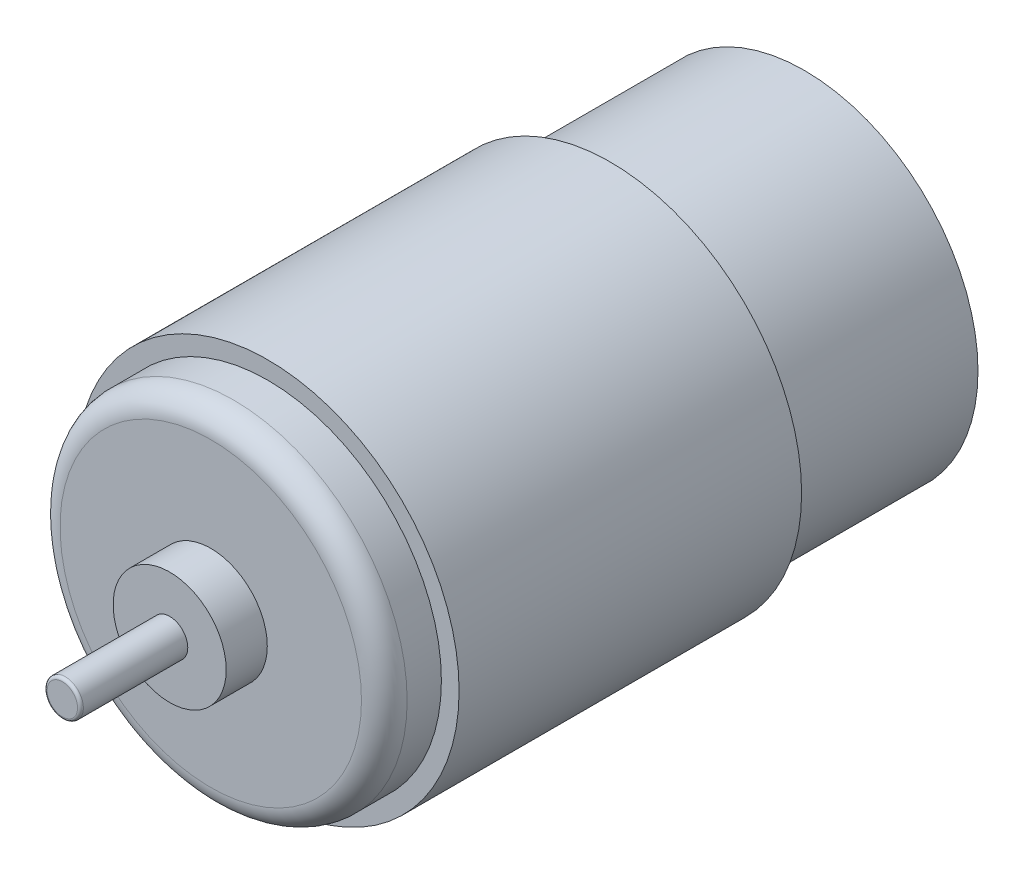
ISO-10303-21;
HEADER;
FILE_DESCRIPTION(('STEP AP214'),'2;1');
FILE_NAME('part.step','',(''),(''),'','','');
FILE_SCHEMA(('AUTOMOTIVE_DESIGN { 1 0 10303 214 1 1 1 1 }'));
ENDSEC;
DATA;
#1=APPLICATION_CONTEXT('core data for automotive mechanical design processes');
#2=APPLICATION_PROTOCOL_DEFINITION('international standard','automotive_design',2000,#1);
#3=PRODUCT_CONTEXT('',#1,'mechanical');
#4=PRODUCT('Part','Part','',(#3));
#5=PRODUCT_RELATED_PRODUCT_CATEGORY('part','',(#4));
#6=PRODUCT_DEFINITION_FORMATION('','',#4);
#7=PRODUCT_DEFINITION_CONTEXT('part definition',#1,'design');
#8=PRODUCT_DEFINITION('design','',#6,#7);
#9=PRODUCT_DEFINITION_SHAPE('','',#8);
#10=(LENGTH_UNIT() NAMED_UNIT(*) SI_UNIT(.MILLI.,.METRE.));
#11=(NAMED_UNIT(*) PLANE_ANGLE_UNIT() SI_UNIT($,.RADIAN.));
#12=(NAMED_UNIT(*) SI_UNIT($,.STERADIAN.) SOLID_ANGLE_UNIT());
#13=UNCERTAINTY_MEASURE_WITH_UNIT(LENGTH_MEASURE(1.E-05),#10,'distance_accuracy_value','');
#14=(GEOMETRIC_REPRESENTATION_CONTEXT(3) GLOBAL_UNCERTAINTY_ASSIGNED_CONTEXT((#13)) GLOBAL_UNIT_ASSIGNED_CONTEXT((#10,
#11,#12)) REPRESENTATION_CONTEXT('',''));
#15=CARTESIAN_POINT('',(0.,0.,0.));
#16=DIRECTION('',(0.,0.,1.));
#17=DIRECTION('',(1.,0.,0.));
#18=AXIS2_PLACEMENT_3D('',#15,#16,#17);
#19=CARTESIAN_POINT('',(0.,0.,38.6));
#20=DIRECTION('',(0.,0.,1.));
#21=DIRECTION('',(1.,0.,0.));
#22=AXIS2_PLACEMENT_3D('',#19,#20,#21);
#23=PLANE('',#22);
#24=CARTESIAN_POINT('',(0.,0.,38.6));
#25=DIRECTION('',(0.,0.,1.));
#26=DIRECTION('',(1.,0.,0.));
#27=AXIS2_PLACEMENT_3D('',#24,#25,#26);
#28=CIRCLE('',#27,4.95);
#29=CARTESIAN_POINT('',(4.95,0.,38.6));
#30=VERTEX_POINT('',#29);
#31=EDGE_CURVE('E66',#30,#30,#28,.T.);
#32=ORIENTED_EDGE('',*,*,#31,.T.);
#33=EDGE_LOOP('',(#32));
#34=FACE_BOUND('',#33,.T.);
#35=CARTESIAN_POINT('',(0.,0.,38.6));
#36=DIRECTION('',(0.,0.,1.));
#37=DIRECTION('',(1.,0.,0.));
#38=AXIS2_PLACEMENT_3D('',#35,#36,#37);
#39=CIRCLE('',#38,1.585);
#40=CARTESIAN_POINT('',(1.585,0.,38.6));
#41=VERTEX_POINT('',#40);
#42=EDGE_CURVE('E76',#41,#41,#39,.T.);
#43=ORIENTED_EDGE('',*,*,#42,.F.);
#44=EDGE_LOOP('',(#43));
#45=FACE_BOUND('',#44,.T.);
#46=ADVANCED_FACE('F31',(#34,#45),#23,.T.);
#47=CARTESIAN_POINT('',(0.,0.,-17.));
#48=DIRECTION('',(0.,0.,-1.));
#49=DIRECTION('',(-1.,0.,0.));
#50=AXIS2_PLACEMENT_3D('',#47,#48,#49);
#51=PLANE('',#50);
#52=CARTESIAN_POINT('',(0.,0.,-17.));
#53=DIRECTION('',(0.,0.,-1.));
#54=DIRECTION('',(-1.,0.,0.));
#55=AXIS2_PLACEMENT_3D('',#52,#53,#54);
#56=CIRCLE('',#55,15.2);
#57=CARTESIAN_POINT('',(-15.2,0.,-17.));
#58=VERTEX_POINT('',#57);
#59=EDGE_CURVE('E63',#58,#58,#56,.T.);
#60=ORIENTED_EDGE('',*,*,#59,.T.);
#61=EDGE_LOOP('',(#60));
#62=FACE_BOUND('',#61,.T.);
#63=CARTESIAN_POINT('',(0.,0.,-17.));
#64=DIRECTION('',(0.,0.,-1.));
#65=DIRECTION('',(-1.,0.,0.));
#66=AXIS2_PLACEMENT_3D('',#63,#64,#65);
#67=CIRCLE('',#66,5.);
#68=CARTESIAN_POINT('',(-5.,0.,-17.));
#69=VERTEX_POINT('',#68);
#70=EDGE_CURVE('E73',#69,#69,#67,.T.);
#71=ORIENTED_EDGE('',*,*,#70,.F.);
#72=EDGE_LOOP('',(#71));
#73=FACE_BOUND('',#72,.T.);
#74=ADVANCED_FACE('F85',(#62,#73),#51,.T.);
#75=CARTESIAN_POINT('',(0.,0.,35.));
#76=DIRECTION('',(0.,0.,1.));
#77=DIRECTION('',(1.,0.,0.));
#78=AXIS2_PLACEMENT_3D('',#75,#76,#77);
#79=PLANE('',#78);
#80=CARTESIAN_POINT('',(0.,0.,35.));
#81=DIRECTION('',(0.,0.,1.));
#82=DIRECTION('',(1.,0.,0.));
#83=AXIS2_PLACEMENT_3D('',#80,#81,#82);
#84=CIRCLE('',#83,13.2);
#85=CARTESIAN_POINT('',(13.2,0.,35.));
#86=VERTEX_POINT('',#85);
#87=EDGE_CURVE('E51',#86,#86,#84,.T.);
#88=ORIENTED_EDGE('',*,*,#87,.T.);
#89=EDGE_LOOP('',(#88));
#90=FACE_BOUND('',#89,.T.);
#91=CARTESIAN_POINT('',(0.,0.,35.));
#92=DIRECTION('',(0.,0.,1.));
#93=DIRECTION('',(1.,0.,0.));
#94=AXIS2_PLACEMENT_3D('',#91,#92,#93);
#95=CIRCLE('',#94,4.95);
#96=CARTESIAN_POINT('',(4.95,0.,35.));
#97=VERTEX_POINT('',#96);
#98=EDGE_CURVE('E67',#97,#97,#95,.T.);
#99=ORIENTED_EDGE('',*,*,#98,.F.);
#100=EDGE_LOOP('',(#99));
#101=FACE_BOUND('',#100,.T.);
#102=ADVANCED_FACE('F91',(#90,#101),#79,.T.);
#103=CARTESIAN_POINT('',(0.,0.,0.));
#104=DIRECTION('',(0.,0.,1.));
#105=DIRECTION('',(1.,0.,0.));
#106=AXIS2_PLACEMENT_3D('',#103,#104,#105);
#107=PLANE('',#106);
#108=CARTESIAN_POINT('',(0.,0.,0.));
#109=DIRECTION('',(0.,0.,1.));
#110=DIRECTION('',(1.,0.,0.));
#111=AXIS2_PLACEMENT_3D('',#108,#109,#110);
#112=CIRCLE('',#111,16.75);
#113=CARTESIAN_POINT('',(16.75,0.,0.));
#114=VERTEX_POINT('',#113);
#115=EDGE_CURVE('E55',#114,#114,#112,.T.);
#116=ORIENTED_EDGE('',*,*,#115,.F.);
#117=EDGE_LOOP('',(#116));
#118=FACE_BOUND('',#117,.T.);
#119=CARTESIAN_POINT('',(0.,0.,0.));
#120=DIRECTION('',(0.,0.,1.));
#121=DIRECTION('',(1.,0.,0.));
#122=AXIS2_PLACEMENT_3D('',#119,#120,#121);
#123=CIRCLE('',#122,15.2);
#124=CARTESIAN_POINT('',(15.2,0.,0.));
#125=VERTEX_POINT('',#124);
#126=EDGE_CURVE('E42',#125,#125,#123,.F.);
#127=ORIENTED_EDGE('',*,*,#126,.F.);
#128=EDGE_LOOP('',(#127));
#129=FACE_BOUND('',#128,.T.);
#130=ADVANCED_FACE('F109',(#118,#129),#107,.F.);
#131=CARTESIAN_POINT('',(0.,0.,30.));
#132=DIRECTION('',(0.,0.,1.));
#133=DIRECTION('',(1.,0.,0.));
#134=AXIS2_PLACEMENT_3D('',#131,#132,#133);
#135=PLANE('',#134);
#136=CARTESIAN_POINT('',(0.,0.,30.));
#137=DIRECTION('',(0.,0.,1.));
#138=DIRECTION('',(1.,0.,0.));
#139=AXIS2_PLACEMENT_3D('',#136,#137,#138);
#140=CIRCLE('',#139,16.75);
#141=CARTESIAN_POINT('',(16.75,0.,30.));
#142=VERTEX_POINT('',#141);
#143=EDGE_CURVE('E54',#142,#142,#140,.T.);
#144=ORIENTED_EDGE('',*,*,#143,.T.);
#145=EDGE_LOOP('',(#144));
#146=FACE_BOUND('',#145,.T.);
#147=CARTESIAN_POINT('',(0.,0.,30.));
#148=DIRECTION('',(0.,0.,1.));
#149=DIRECTION('',(1.,0.,0.));
#150=AXIS2_PLACEMENT_3D('',#147,#148,#149);
#151=CIRCLE('',#150,15.2);
#152=CARTESIAN_POINT('',(15.2,0.,30.));
#153=VERTEX_POINT('',#152);
#154=EDGE_CURVE('E58',#153,#153,#151,.T.);
#155=ORIENTED_EDGE('',*,*,#154,.F.);
#156=EDGE_LOOP('',(#155));
#157=FACE_BOUND('',#156,.T.);
#158=ADVANCED_FACE('F116',(#146,#157),#135,.T.);
#159=CARTESIAN_POINT('',(0.,0.,30.));
#160=DIRECTION('',(0.,0.,-1.));
#161=DIRECTION('',(-1.,0.,0.));
#162=AXIS2_PLACEMENT_3D('',#159,#160,#161);
#163=CYLINDRICAL_SURFACE('',#162,16.75);
#164=ORIENTED_EDGE('',*,*,#143,.F.);
#165=EDGE_LOOP('',(#164));
#166=FACE_BOUND('',#165,.T.);
#167=ORIENTED_EDGE('',*,*,#115,.T.);
#168=EDGE_LOOP('',(#167));
#169=FACE_BOUND('',#168,.T.);
#170=ADVANCED_FACE('F114',(#166,#169),#163,.T.);
#171=CARTESIAN_POINT('',(0.,0.,35.));
#172=DIRECTION('',(0.,0.,-1.));
#173=DIRECTION('',(-1.,0.,0.));
#174=AXIS2_PLACEMENT_3D('',#171,#172,#173);
#175=CYLINDRICAL_SURFACE('',#174,15.2);
#176=CARTESIAN_POINT('',(0.,0.,33.));
#177=DIRECTION('',(0.,0.,1.));
#178=DIRECTION('',(1.,0.,0.));
#179=AXIS2_PLACEMENT_3D('',#176,#177,#178);
#180=CIRCLE('',#179,15.2);
#181=CARTESIAN_POINT('',(15.2,0.,33.));
#182=VERTEX_POINT('',#181);
#183=EDGE_CURVE('E46',#182,#182,#180,.F.);
#184=ORIENTED_EDGE('',*,*,#183,.T.);
#185=EDGE_LOOP('',(#184));
#186=FACE_BOUND('',#185,.T.);
#187=ORIENTED_EDGE('',*,*,#154,.T.);
#188=EDGE_LOOP('',(#187));
#189=FACE_BOUND('',#188,.T.);
#190=ADVANCED_FACE('F111',(#186,#189),#175,.T.);
#191=CARTESIAN_POINT('',(0.,0.,33.));
#192=DIRECTION('',(0.,0.,1.));
#193=DIRECTION('',(1.,0.,0.));
#194=AXIS2_PLACEMENT_3D('',#191,#192,#193);
#195=TOROIDAL_SURFACE('',#194,13.2,2.);
#196=ORIENTED_EDGE('',*,*,#183,.F.);
#197=EDGE_LOOP('',(#196));
#198=FACE_BOUND('',#197,.T.);
#199=ORIENTED_EDGE('',*,*,#87,.F.);
#200=EDGE_LOOP('',(#199));
#201=FACE_BOUND('',#200,.T.);
#202=ADVANCED_FACE('F105',(#198,#201),#195,.T.);
#203=CARTESIAN_POINT('',(0.,0.,-17.));
#204=DIRECTION('',(0.,0.,1.));
#205=DIRECTION('',(1.,0.,0.));
#206=AXIS2_PLACEMENT_3D('',#203,#204,#205);
#207=CYLINDRICAL_SURFACE('',#206,15.2);
#208=ORIENTED_EDGE('',*,*,#59,.F.);
#209=EDGE_LOOP('',(#208));
#210=FACE_BOUND('',#209,.T.);
#211=ORIENTED_EDGE('',*,*,#126,.T.);
#212=EDGE_LOOP('',(#211));
#213=FACE_BOUND('',#212,.T.);
#214=ADVANCED_FACE('F100',(#210,#213),#207,.T.);
#215=CARTESIAN_POINT('',(0.,0.,38.6));
#216=DIRECTION('',(0.,0.,-1.));
#217=DIRECTION('',(-1.,0.,0.));
#218=AXIS2_PLACEMENT_3D('',#215,#216,#217);
#219=CYLINDRICAL_SURFACE('',#218,4.95);
#220=ORIENTED_EDGE('',*,*,#31,.F.);
#221=EDGE_LOOP('',(#220));
#222=FACE_BOUND('',#221,.T.);
#223=ORIENTED_EDGE('',*,*,#98,.T.);
#224=EDGE_LOOP('',(#223));
#225=FACE_BOUND('',#224,.T.);
#226=ADVANCED_FACE('F98',(#222,#225),#219,.T.);
#227=CARTESIAN_POINT('',(0.,0.,-19.6));
#228=DIRECTION('',(0.,0.,1.));
#229=DIRECTION('',(1.,0.,0.));
#230=AXIS2_PLACEMENT_3D('',#227,#228,#229);
#231=CYLINDRICAL_SURFACE('',#230,5.);
#232=CARTESIAN_POINT('',(0.,0.,-19.6));
#233=DIRECTION('',(0.,0.,-1.));
#234=DIRECTION('',(-1.,0.,0.));
#235=AXIS2_PLACEMENT_3D('',#232,#233,#234);
#236=CIRCLE('',#235,5.);
#237=CARTESIAN_POINT('',(-5.,0.,-19.6));
#238=VERTEX_POINT('',#237);
#239=EDGE_CURVE('E70',#238,#238,#236,.T.);
#240=ORIENTED_EDGE('',*,*,#239,.F.);
#241=EDGE_LOOP('',(#240));
#242=FACE_BOUND('',#241,.T.);
#243=ORIENTED_EDGE('',*,*,#70,.T.);
#244=EDGE_LOOP('',(#243));
#245=FACE_BOUND('',#244,.T.);
#246=ADVANCED_FACE('F96',(#242,#245),#231,.T.);
#247=CARTESIAN_POINT('',(0.,0.,-19.6));
#248=DIRECTION('',(0.,0.,-1.));
#249=DIRECTION('',(-1.,0.,0.));
#250=AXIS2_PLACEMENT_3D('',#247,#248,#249);
#251=PLANE('',#250);
#252=ORIENTED_EDGE('',*,*,#239,.T.);
#253=EDGE_LOOP('',(#252));
#254=FACE_BOUND('',#253,.T.);
#255=ADVANCED_FACE('F157',(#254),#251,.T.);
#256=CARTESIAN_POINT('',(0.,0.,48.));
#257=DIRECTION('',(0.,0.,-1.));
#258=DIRECTION('',(-1.,0.,0.));
#259=AXIS2_PLACEMENT_3D('',#256,#257,#258);
#260=CYLINDRICAL_SURFACE('',#259,1.585);
#261=CARTESIAN_POINT('',(0.,0.,47.746));
#262=DIRECTION('',(0.,0.,1.));
#263=DIRECTION('',(1.,0.,0.));
#264=AXIS2_PLACEMENT_3D('',#261,#262,#263);
#265=CIRCLE('',#264,1.585);
#266=CARTESIAN_POINT('',(1.585,0.,47.746));
#267=VERTEX_POINT('',#266);
#268=EDGE_CURVE('E10',#267,#267,#265,.F.);
#269=ORIENTED_EDGE('',*,*,#268,.T.);
#270=EDGE_LOOP('',(#269));
#271=FACE_BOUND('',#270,.T.);
#272=ORIENTED_EDGE('',*,*,#42,.T.);
#273=EDGE_LOOP('',(#272));
#274=FACE_BOUND('',#273,.T.);
#275=ADVANCED_FACE('F82',(#271,#274),#260,.T.);
#276=CARTESIAN_POINT('',(0.,0.,48.));
#277=DIRECTION('',(0.,0.,1.));
#278=DIRECTION('',(1.,0.,0.));
#279=AXIS2_PLACEMENT_3D('',#276,#277,#278);
#280=PLANE('',#279);
#281=CARTESIAN_POINT('',(0.,0.,48.));
#282=DIRECTION('',(0.,0.,1.));
#283=DIRECTION('',(1.,0.,0.));
#284=AXIS2_PLACEMENT_3D('',#281,#282,#283);
#285=CIRCLE('',#284,1.331);
#286=CARTESIAN_POINT('',(1.331,0.,48.));
#287=VERTEX_POINT('',#286);
#288=EDGE_CURVE('E38',#287,#287,#285,.T.);
#289=ORIENTED_EDGE('',*,*,#288,.T.);
#290=EDGE_LOOP('',(#289));
#291=FACE_BOUND('',#290,.T.);
#292=ADVANCED_FACE('F170',(#291),#280,.T.);
#293=CARTESIAN_POINT('',(0.,0.,47.746));
#294=DIRECTION('',(0.,0.,1.));
#295=DIRECTION('',(1.,0.,0.));
#296=AXIS2_PLACEMENT_3D('',#293,#294,#295);
#297=TOROIDAL_SURFACE('',#296,1.331,0.254);
#298=ORIENTED_EDGE('',*,*,#268,.F.);
#299=EDGE_LOOP('',(#298));
#300=FACE_BOUND('',#299,.T.);
#301=ORIENTED_EDGE('',*,*,#288,.F.);
#302=EDGE_LOOP('',(#301));
#303=FACE_BOUND('',#302,.T.);
#304=ADVANCED_FACE('F33',(#300,#303),#297,.T.);
#305=CLOSED_SHELL('',(#46,#74,#102,#130,#158,#170,#190,#202,#214,#226,#246,#255,#275,#292,#304));
#306=MANIFOLD_SOLID_BREP('B2',#305);
#307=ADVANCED_BREP_SHAPE_REPRESENTATION('',(#18,#306),#14);
#308=SHAPE_DEFINITION_REPRESENTATION(#9,#307);
ENDSEC;
END-ISO-10303-21;
